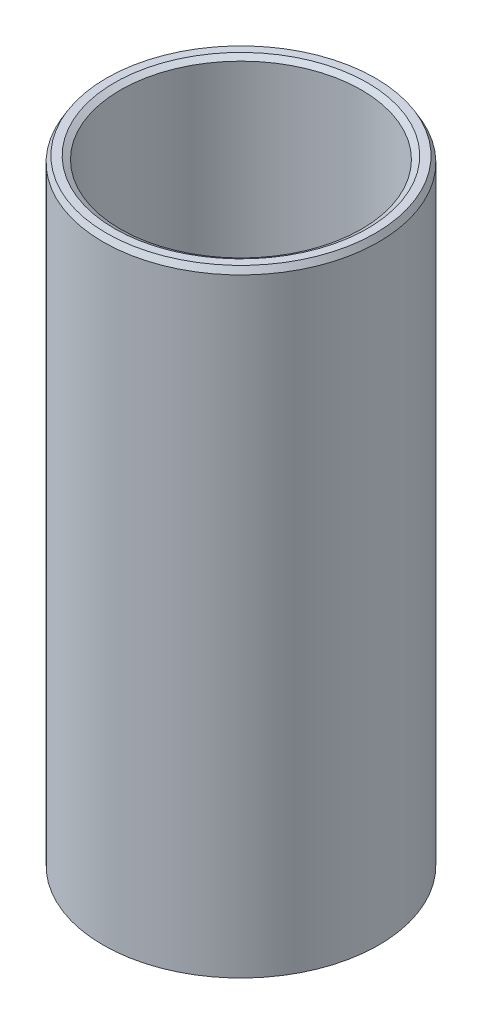
ISO-10303-21;
HEADER;
FILE_DESCRIPTION(('STEP AP214'),'2;1');
FILE_NAME('part.step','',(''),(''),'','','');
FILE_SCHEMA(('AUTOMOTIVE_DESIGN { 1 0 10303 214 1 1 1 1 }'));
ENDSEC;
DATA;
#1=APPLICATION_CONTEXT('core data for automotive mechanical design processes');
#2=APPLICATION_PROTOCOL_DEFINITION('international standard','automotive_design',2000,#1);
#3=PRODUCT_CONTEXT('',#1,'mechanical');
#4=PRODUCT('Part','Part','',(#3));
#5=PRODUCT_RELATED_PRODUCT_CATEGORY('part','',(#4));
#6=PRODUCT_DEFINITION_FORMATION('','',#4);
#7=PRODUCT_DEFINITION_CONTEXT('part definition',#1,'design');
#8=PRODUCT_DEFINITION('design','',#6,#7);
#9=PRODUCT_DEFINITION_SHAPE('','',#8);
#10=(LENGTH_UNIT() NAMED_UNIT(*) SI_UNIT(.MILLI.,.METRE.));
#11=(NAMED_UNIT(*) PLANE_ANGLE_UNIT() SI_UNIT($,.RADIAN.));
#12=(NAMED_UNIT(*) SI_UNIT($,.STERADIAN.) SOLID_ANGLE_UNIT());
#13=UNCERTAINTY_MEASURE_WITH_UNIT(LENGTH_MEASURE(1.E-05),#10,'distance_accuracy_value','');
#14=(GEOMETRIC_REPRESENTATION_CONTEXT(3) GLOBAL_UNCERTAINTY_ASSIGNED_CONTEXT((#13)) GLOBAL_UNIT_ASSIGNED_CONTEXT((#10,
#11,#12)) REPRESENTATION_CONTEXT('',''));
#15=CARTESIAN_POINT('',(0.,0.,0.));
#16=DIRECTION('',(0.,0.,1.));
#17=DIRECTION('',(1.,0.,0.));
#18=AXIS2_PLACEMENT_3D('',#15,#16,#17);
#19=CARTESIAN_POINT('',(0.,134.570657125877,0.));
#20=DIRECTION('',(0.,-1.,0.));
#21=DIRECTION('',(0.,0.,-1.));
#22=AXIS2_PLACEMENT_3D('',#19,#20,#21);
#23=CYLINDRICAL_SURFACE('',#22,30.);
#24=CARTESIAN_POINT('',(0.,0.738959148055246,0.));
#25=DIRECTION('',(0.,1.,0.));
#26=DIRECTION('',(0.,0.,1.));
#27=AXIS2_PLACEMENT_3D('',#24,#25,#26);
#28=CIRCLE('',#27,30.);
#29=CARTESIAN_POINT('',(0.,0.738959148055246,30.));
#30=VERTEX_POINT('',#29);
#31=EDGE_CURVE('E10',#30,#30,#28,.T.);
#32=ORIENTED_EDGE('',*,*,#31,.T.);
#33=EDGE_LOOP('',(#32));
#34=FACE_BOUND('',#33,.T.);
#35=CARTESIAN_POINT('',(0.,133.290742336727,0.));
#36=DIRECTION('',(0.,1.,0.));
#37=DIRECTION('',(0.,0.,1.));
#38=AXIS2_PLACEMENT_3D('',#35,#36,#37);
#39=CIRCLE('',#38,30.);
#40=CARTESIAN_POINT('',(0.,133.290742336727,30.));
#41=VERTEX_POINT('',#40);
#42=EDGE_CURVE('E50',#41,#41,#39,.F.);
#43=ORIENTED_EDGE('',*,*,#42,.T.);
#44=EDGE_LOOP('',(#43));
#45=FACE_BOUND('',#44,.T.);
#46=ADVANCED_FACE('F39',(#34,#45),#23,.T.);
#47=CARTESIAN_POINT('',(0.,134.570657125877,0.));
#48=DIRECTION('',(0.,1.,0.));
#49=DIRECTION('',(0.,0.,1.));
#50=AXIS2_PLACEMENT_3D('',#47,#48,#49);
#51=PLANE('',#50);
#52=CARTESIAN_POINT('',(0.,134.570657125877,0.));
#53=DIRECTION('',(0.,1.,0.));
#54=DIRECTION('',(0.,0.,1.));
#55=AXIS2_PLACEMENT_3D('',#52,#53,#54);
#56=CIRCLE('',#55,27.5231932137042);
#57=CARTESIAN_POINT('',(0.,134.570657125877,27.5231932137042));
#58=VERTEX_POINT('',#57);
#59=EDGE_CURVE('E58',#58,#58,#56,.F.);
#60=ORIENTED_EDGE('',*,*,#59,.T.);
#61=EDGE_LOOP('',(#60));
#62=FACE_BOUND('',#61,.T.);
#63=CARTESIAN_POINT('',(0.,134.570657125877,0.));
#64=DIRECTION('',(0.,1.,0.));
#65=DIRECTION('',(0.,0.,1.));
#66=AXIS2_PLACEMENT_3D('',#63,#64,#65);
#67=CIRCLE('',#66,29.2610408519447);
#68=CARTESIAN_POINT('',(0.,134.570657125877,29.2610408519447));
#69=VERTEX_POINT('',#68);
#70=EDGE_CURVE('E61',#69,#69,#67,.T.);
#71=ORIENTED_EDGE('',*,*,#70,.T.);
#72=EDGE_LOOP('',(#71));
#73=FACE_BOUND('',#72,.T.);
#74=ADVANCED_FACE('F88',(#62,#73),#51,.T.);
#75=CARTESIAN_POINT('',(0.,0.,0.));
#76=DIRECTION('',(0.,1.,0.));
#77=DIRECTION('',(0.,0.,1.));
#78=AXIS2_PLACEMENT_3D('',#75,#76,#77);
#79=PLANE('',#78);
#80=CARTESIAN_POINT('',(0.,0.,0.));
#81=DIRECTION('',(0.,1.,0.));
#82=DIRECTION('',(0.,0.,1.));
#83=AXIS2_PLACEMENT_3D('',#80,#81,#82);
#84=CIRCLE('',#83,26.9822375726099);
#85=CARTESIAN_POINT('',(0.,0.,-26.9822375726099));
#86=VERTEX_POINT('',#85);
#87=EDGE_CURVE('E51',#86,#86,#84,.T.);
#88=ORIENTED_EDGE('',*,*,#87,.T.);
#89=EDGE_LOOP('',(#88));
#90=FACE_BOUND('',#89,.T.);
#91=CARTESIAN_POINT('',(0.,0.,0.));
#92=DIRECTION('',(0.,1.,0.));
#93=DIRECTION('',(0.,0.,1.));
#94=AXIS2_PLACEMENT_3D('',#91,#92,#93);
#95=CIRCLE('',#94,28.7200852108505);
#96=CARTESIAN_POINT('',(0.,0.,28.7200852108505));
#97=VERTEX_POINT('',#96);
#98=EDGE_CURVE('E54',#97,#97,#95,.F.);
#99=ORIENTED_EDGE('',*,*,#98,.T.);
#100=EDGE_LOOP('',(#99));
#101=FACE_BOUND('',#100,.T.);
#102=ADVANCED_FACE('F83',(#90,#101),#79,.F.);
#103=CARTESIAN_POINT('',(0.,134.570657125877,0.));
#104=DIRECTION('',(0.,-1.,0.));
#105=DIRECTION('',(0.,0.,-1.));
#106=AXIS2_PLACEMENT_3D('',#103,#104,#105);
#107=CYLINDRICAL_SURFACE('',#106,26.2432784245546);
#108=CARTESIAN_POINT('',(0.,133.831697977821,0.));
#109=DIRECTION('',(0.,1.,0.));
#110=DIRECTION('',(0.,0.,1.));
#111=AXIS2_PLACEMENT_3D('',#108,#109,#110);
#112=CIRCLE('',#111,26.2432784245546);
#113=CARTESIAN_POINT('',(0.,133.831697977821,26.2432784245546));
#114=VERTEX_POINT('',#113);
#115=EDGE_CURVE('E67',#114,#114,#112,.T.);
#116=ORIENTED_EDGE('',*,*,#115,.T.);
#117=EDGE_LOOP('',(#116));
#118=FACE_BOUND('',#117,.T.);
#119=CARTESIAN_POINT('',(0.,1.27991478914957,0.));
#120=DIRECTION('',(0.,1.,0.));
#121=DIRECTION('',(0.,0.,1.));
#122=AXIS2_PLACEMENT_3D('',#119,#120,#121);
#123=CIRCLE('',#122,26.2432784245546);
#124=CARTESIAN_POINT('',(0.,1.27991478914957,-26.2432784245546));
#125=VERTEX_POINT('',#124);
#126=EDGE_CURVE('E69',#125,#125,#123,.F.);
#127=ORIENTED_EDGE('',*,*,#126,.T.);
#128=EDGE_LOOP('',(#127));
#129=FACE_BOUND('',#128,.T.);
#130=ADVANCED_FACE('F71',(#118,#129),#107,.F.);
#131=CARTESIAN_POINT('',(0.,133.831697977821,0.));
#132=DIRECTION('',(0.,1.,0.));
#133=DIRECTION('',(0.,0.,1.));
#134=AXIS2_PLACEMENT_3D('',#131,#132,#133);
#135=CONICAL_SURFACE('',#134,26.2432784245546,1.04719755119659);
#136=ORIENTED_EDGE('',*,*,#59,.F.);
#137=EDGE_LOOP('',(#136));
#138=FACE_BOUND('',#137,.T.);
#139=ORIENTED_EDGE('',*,*,#115,.F.);
#140=EDGE_LOOP('',(#139));
#141=FACE_BOUND('',#140,.T.);
#142=ADVANCED_FACE('F77',(#138,#141),#135,.F.);
#143=CARTESIAN_POINT('',(0.,0.,0.));
#144=DIRECTION('',(0.,-1.,0.));
#145=DIRECTION('',(0.,0.,-1.));
#146=AXIS2_PLACEMENT_3D('',#143,#144,#145);
#147=CONICAL_SURFACE('',#146,26.9822375726099,0.523598775598292);
#148=CARTESIAN_POINT('',(0.,1.27991478914957,-26.2432784245546));
#149=CARTESIAN_POINT('',(0.,1.26658234342926,-26.2509759156802));
#150=CARTESIAN_POINT('',(0.,1.25324989770896,-26.2586734068058));
#151=CARTESIAN_POINT('',(0.,1.22658500626834,-26.2740683890569));
#152=CARTESIAN_POINT('',(0.,1.21325256054803,-26.2817658801825));
#153=CARTESIAN_POINT('',(0.,1.18658766910742,-26.2971608624337));
#154=CARTESIAN_POINT('',(0.,1.17325522338711,-26.3048583535593));
#155=CARTESIAN_POINT('',(0.,1.14659033194649,-26.3202533358104));
#156=CARTESIAN_POINT('',(0.,1.13325788622618,-26.327950826936));
#157=CARTESIAN_POINT('',(0.,1.10659299478557,-26.3433458091871));
#158=CARTESIAN_POINT('',(0.,1.09326054906526,-26.3510433003127));
#159=CARTESIAN_POINT('',(0.,1.06659565762464,-26.3664382825639));
#160=CARTESIAN_POINT('',(0.,1.05326321190434,-26.3741357736894));
#161=CARTESIAN_POINT('',(0.,1.02659832046372,-26.3895307559406));
#162=CARTESIAN_POINT('',(0.,1.01326587474341,-26.3972282470662));
#163=CARTESIAN_POINT('',(0.,0.986600983302795,-26.4126232293173));
#164=CARTESIAN_POINT('',(0.,0.973268537582487,-26.4203207204429));
#165=CARTESIAN_POINT('',(0.,0.946603646141871,-26.435715702694));
#166=CARTESIAN_POINT('',(0.,0.933271200421563,-26.4434131938196));
#167=CARTESIAN_POINT('',(0.,0.906606308980947,-26.4588081760708));
#168=CARTESIAN_POINT('',(0.,0.893273863260639,-26.4665056671963));
#169=CARTESIAN_POINT('',(0.,0.866608971820022,-26.4819006494475));
#170=CARTESIAN_POINT('',(0.,0.853276526099715,-26.4895981405731));
#171=CARTESIAN_POINT('',(0.,0.826611634659099,-26.5049931228242));
#172=CARTESIAN_POINT('',(0.,0.81327918893879,-26.5126906139498));
#173=CARTESIAN_POINT('',(0.,0.786614297498174,-26.5280855962009));
#174=CARTESIAN_POINT('',(0.,0.773281851777867,-26.5357830873265));
#175=CARTESIAN_POINT('',(0.,0.746616960337251,-26.5511780695777));
#176=CARTESIAN_POINT('',(0.,0.733284514616942,-26.5588755607033));
#177=CARTESIAN_POINT('',(0.,0.706619623176326,-26.5742705429544));
#178=CARTESIAN_POINT('',(0.,0.693287177456018,-26.58196803408));
#179=CARTESIAN_POINT('',(0.,0.666622286015402,-26.5973630163311));
#180=CARTESIAN_POINT('',(0.,0.653289840295094,-26.6050605074567));
#181=CARTESIAN_POINT('',(0.,0.626624948854478,-26.6204554897079));
#182=CARTESIAN_POINT('',(0.,0.61329250313417,-26.6281529808334));
#183=CARTESIAN_POINT('',(0.,0.586627611693554,-26.6435479630846));
#184=CARTESIAN_POINT('',(0.,0.573295165973246,-26.6512454542102));
#185=CARTESIAN_POINT('',(0.,0.54663027453263,-26.6666404364613));
#186=CARTESIAN_POINT('',(0.,0.533297828812321,-26.6743379275869));
#187=CARTESIAN_POINT('',(0.,0.506632937371705,-26.689732909838));
#188=CARTESIAN_POINT('',(0.,0.493300491651398,-26.6974304009636));
#189=CARTESIAN_POINT('',(0.,0.466635600210782,-26.7128253832148));
#190=CARTESIAN_POINT('',(0.,0.453303154490473,-26.7205228743403));
#191=CARTESIAN_POINT('',(0.,0.426638263049857,-26.7359178565915));
#192=CARTESIAN_POINT('',(0.,0.41330581732955,-26.7436153477171));
#193=CARTESIAN_POINT('',(0.,0.386640925888933,-26.7590103299682));
#194=CARTESIAN_POINT('',(0.,0.373308480168625,-26.7667078210938));
#195=CARTESIAN_POINT('',(0.,0.346643588728009,-26.782102803345));
#196=CARTESIAN_POINT('',(0.,0.333311143007701,-26.7898002944705));
#197=CARTESIAN_POINT('',(0.,0.306646251567085,-26.8051952767217));
#198=CARTESIAN_POINT('',(0.,0.293313805846777,-26.8128927678473));
#199=CARTESIAN_POINT('',(0.,0.266648914406161,-26.8282877500984));
#200=CARTESIAN_POINT('',(0.,0.253316468685853,-26.835985241224));
#201=CARTESIAN_POINT('',(0.,0.226651577245237,-26.8513802234751));
#202=CARTESIAN_POINT('',(0.,0.213319131524928,-26.8590777146007));
#203=CARTESIAN_POINT('',(0.,0.186654240084312,-26.8744726968519));
#204=CARTESIAN_POINT('',(0.,0.173321794364005,-26.8821701879774));
#205=CARTESIAN_POINT('',(0.,0.146656902923389,-26.8975651702286));
#206=CARTESIAN_POINT('',(0.,0.13332445720308,-26.9052626613542));
#207=CARTESIAN_POINT('',(0.,0.106659565762464,-26.9206576436053));
#208=CARTESIAN_POINT('',(0.,0.0933271200421565,-26.9283551347309));
#209=CARTESIAN_POINT('',(0.,0.0666622286015405,-26.943750116982));
#210=CARTESIAN_POINT('',(0.,0.0533297828812322,-26.9514476081076));
#211=CARTESIAN_POINT('',(0.,0.0266648914406155,-26.9668425903588));
#212=CARTESIAN_POINT('',(0.,0.0133324457203072,-26.9745400814843));
#213=CARTESIAN_POINT('',(0.,0.,-26.9822375726099));
#214=B_SPLINE_CURVE_WITH_KNOTS('',3,(#148,#149,#150,#151,#152,#153,#154,#155,#156,#157,#158,
#159,#160,#161,#162,#163,#164,#165,#166,#167,#168,#169,#170,#171,#172,#173,#174,#175,#176,#177,
#178,#179,#180,#181,#182,#183,#184,#185,#186,#187,#188,#189,#190,#191,#192,#193,#194,#195,#196,
#197,#198,#199,#200,#201,#202,#203,#204,#205,#206,#207,#208,#209,#210,#211,#212,#213),
.UNSPECIFIED.,.F.,.F.,(4,2,2,2,2,2,2,2,2,2,2,2,2,2,2,2,2,2,2,2,2,2,2,2,2,2,2,2,2,2,2,2,4),(0.,
0.0461849467534544,0.0923698935069106,0.138554840260367,0.184739787013821,0.230924733767277,
0.277109680520732,0.323294627274188,0.369479574027642,0.415664520781099,0.461849467534553,
0.508034414288009,0.554219361041464,0.60040430779492,0.646589254548374,0.69277420130183,
0.738959148055285,0.785144094808741,0.831329041562197,0.877513988315651,0.923698935069107,
0.969883881822562,1.01606882857602,1.06225377532947,1.10843872208293,1.15462366883638,
1.20080861558984,1.24699356234329,1.29317850909675,1.3393634558502,1.38554840260366,
1.43173334935711,1.47791829611057),.UNSPECIFIED.);
#215=EDGE_CURVE('BSEAM73',#125,#86,#214,.T.);
#216=ORIENTED_EDGE('',*,*,#126,.F.);
#217=ORIENTED_EDGE('',*,*,#87,.F.);
#218=ORIENTED_EDGE('',*,*,#215,.T.);
#219=ORIENTED_EDGE('',*,*,#215,.F.);
#220=EDGE_LOOP('',(#216,#218,#217,#219));
#221=FACE_BOUND('',#220,.T.);
#222=ADVANCED_FACE('F73',(#221),#147,.F.);
#223=CARTESIAN_POINT('',(0.,0.738959148055246,0.));
#224=DIRECTION('',(0.,1.,0.));
#225=DIRECTION('',(0.,0.,1.));
#226=AXIS2_PLACEMENT_3D('',#223,#224,#225);
#227=CONICAL_SURFACE('',#226,30.,1.0471975511966);
#228=ORIENTED_EDGE('',*,*,#98,.F.);
#229=EDGE_LOOP('',(#228));
#230=FACE_BOUND('',#229,.T.);
#231=ORIENTED_EDGE('',*,*,#31,.F.);
#232=EDGE_LOOP('',(#231));
#233=FACE_BOUND('',#232,.T.);
#234=ADVANCED_FACE('F76',(#230,#233),#227,.T.);
#235=CARTESIAN_POINT('',(0.,134.570657125877,0.));
#236=DIRECTION('',(0.,-1.,0.));
#237=DIRECTION('',(0.,0.,-1.));
#238=AXIS2_PLACEMENT_3D('',#235,#236,#237);
#239=CONICAL_SURFACE('',#238,29.2610408519447,0.523598775598301);
#240=ORIENTED_EDGE('',*,*,#42,.F.);
#241=EDGE_LOOP('',(#240));
#242=FACE_BOUND('',#241,.T.);
#243=ORIENTED_EDGE('',*,*,#70,.F.);
#244=EDGE_LOOP('',(#243));
#245=FACE_BOUND('',#244,.T.);
#246=ADVANCED_FACE('F45',(#242,#245),#239,.T.);
#247=CLOSED_SHELL('',(#46,#74,#102,#130,#142,#222,#234,#246));
#248=MANIFOLD_SOLID_BREP('B2',#247);
#249=ADVANCED_BREP_SHAPE_REPRESENTATION('',(#18,#248),#14);
#250=SHAPE_DEFINITION_REPRESENTATION(#9,#249);
ENDSEC;
END-ISO-10303-21;
